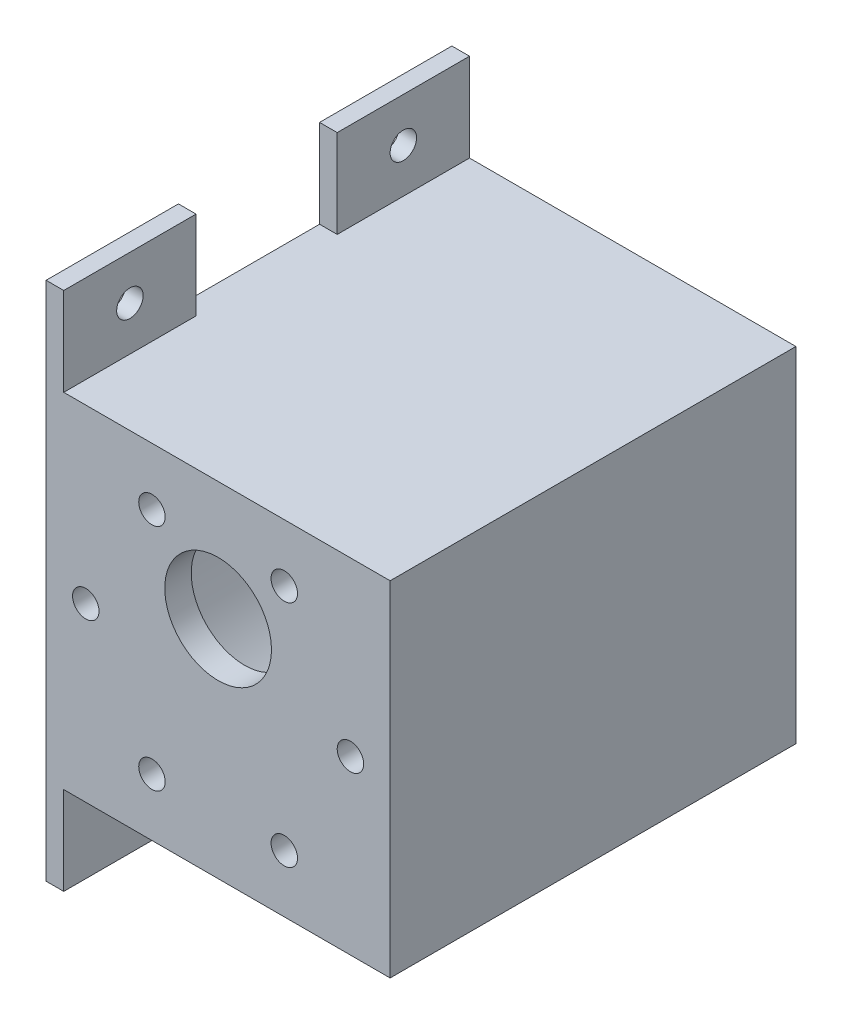
ISO-10303-21;
HEADER;
FILE_DESCRIPTION(('STEP AP214'),'2;1');
FILE_NAME('part.step','',(''),(''),'','','');
FILE_SCHEMA(('AUTOMOTIVE_DESIGN { 1 0 10303 214 1 1 1 1 }'));
ENDSEC;
DATA;
#1=APPLICATION_CONTEXT('core data for automotive mechanical design processes');
#2=APPLICATION_PROTOCOL_DEFINITION('international standard','automotive_design',2000,#1);
#3=PRODUCT_CONTEXT('',#1,'mechanical');
#4=PRODUCT('Part','Part','',(#3));
#5=PRODUCT_RELATED_PRODUCT_CATEGORY('part','',(#4));
#6=PRODUCT_DEFINITION_FORMATION('','',#4);
#7=PRODUCT_DEFINITION_CONTEXT('part definition',#1,'design');
#8=PRODUCT_DEFINITION('design','',#6,#7);
#9=PRODUCT_DEFINITION_SHAPE('','',#8);
#10=(LENGTH_UNIT() NAMED_UNIT(*) SI_UNIT(.MILLI.,.METRE.));
#11=(NAMED_UNIT(*) PLANE_ANGLE_UNIT() SI_UNIT($,.RADIAN.));
#12=(NAMED_UNIT(*) SI_UNIT($,.STERADIAN.) SOLID_ANGLE_UNIT());
#13=UNCERTAINTY_MEASURE_WITH_UNIT(LENGTH_MEASURE(1.E-05),#10,'distance_accuracy_value','');
#14=(GEOMETRIC_REPRESENTATION_CONTEXT(3) GLOBAL_UNCERTAINTY_ASSIGNED_CONTEXT((#13)) GLOBAL_UNIT_ASSIGNED_CONTEXT((#10,
#11,#12)) REPRESENTATION_CONTEXT('',''));
#15=CARTESIAN_POINT('',(0.,0.,0.));
#16=DIRECTION('',(0.,0.,1.));
#17=DIRECTION('',(1.,0.,0.));
#18=AXIS2_PLACEMENT_3D('',#15,#16,#17);
#19=CARTESIAN_POINT('',(-19.5,19.5,-18.));
#20=DIRECTION('',(0.,1.,0.));
#21=DIRECTION('',(0.,0.,1.));
#22=AXIS2_PLACEMENT_3D('',#19,#20,#21);
#23=PLANE('',#22);
#24=DIRECTION('',(-1.,0.,0.));
#25=VECTOR('',#24,1.);
#26=CARTESIAN_POINT('',(-17.5,19.5,-12.));
#27=LINE('',#26,#25);
#28=CARTESIAN_POINT('',(-17.5,19.5,-12.));
#29=VERTEX_POINT('',#28);
#30=CARTESIAN_POINT('',(-19.5,19.5,-12.));
#31=VERTEX_POINT('',#30);
#32=EDGE_CURVE('E51',#29,#31,#27,.T.);
#33=ORIENTED_EDGE('',*,*,#32,.F.);
#34=DIRECTION('',(0.,0.,1.));
#35=VECTOR('',#34,1.);
#36=CARTESIAN_POINT('',(-17.5,19.5,-12.));
#37=LINE('',#36,#35);
#38=CARTESIAN_POINT('',(-17.5,19.5,3.));
#39=VERTEX_POINT('',#38);
#40=EDGE_CURVE('E55',#29,#39,#37,.T.);
#41=ORIENTED_EDGE('',*,*,#40,.T.);
#42=DIRECTION('',(-1.,0.,0.));
#43=VECTOR('',#42,1.);
#44=CARTESIAN_POINT('',(-19.5,19.5,3.));
#45=LINE('',#44,#43);
#46=CARTESIAN_POINT('',(19.5,19.5,3.));
#47=VERTEX_POINT('',#46);
#48=EDGE_CURVE('E454',#47,#39,#45,.T.);
#49=ORIENTED_EDGE('',*,*,#48,.F.);
#50=DIRECTION('',(0.,0.,1.));
#51=VECTOR('',#50,1.);
#52=CARTESIAN_POINT('',(19.5,19.5,-18.));
#53=LINE('',#52,#51);
#54=CARTESIAN_POINT('',(19.5,19.5,-43.));
#55=VERTEX_POINT('',#54);
#56=EDGE_CURVE('E336',#55,#47,#53,.T.);
#57=ORIENTED_EDGE('',*,*,#56,.F.);
#58=DIRECTION('',(1.,0.,0.));
#59=VECTOR('',#58,1.);
#60=CARTESIAN_POINT('',(19.5,19.5,-43.));
#61=LINE('',#60,#59);
#62=CARTESIAN_POINT('',(-17.5,19.5,-43.));
#63=VERTEX_POINT('',#62);
#64=EDGE_CURVE('E340',#63,#55,#61,.T.);
#65=ORIENTED_EDGE('',*,*,#64,.F.);
#66=DIRECTION('',(0.,0.,1.));
#67=VECTOR('',#66,1.);
#68=CARTESIAN_POINT('',(-17.5,19.5,-43.));
#69=LINE('',#68,#67);
#70=CARTESIAN_POINT('',(-17.5,19.5,-28.));
#71=VERTEX_POINT('',#70);
#72=EDGE_CURVE('E295',#63,#71,#69,.T.);
#73=ORIENTED_EDGE('',*,*,#72,.T.);
#74=DIRECTION('',(-1.,0.,0.));
#75=VECTOR('',#74,1.);
#76=CARTESIAN_POINT('',(-17.5,19.5,-28.));
#77=LINE('',#76,#75);
#78=CARTESIAN_POINT('',(-19.5,19.5,-28.));
#79=VERTEX_POINT('',#78);
#80=EDGE_CURVE('E308',#71,#79,#77,.T.);
#81=ORIENTED_EDGE('',*,*,#80,.T.);
#82=DIRECTION('',(0.,0.,1.));
#83=VECTOR('',#82,1.);
#84=CARTESIAN_POINT('',(-19.5,19.5,-18.));
#85=LINE('',#84,#83);
#86=EDGE_CURVE('E329',#79,#31,#85,.T.);
#87=ORIENTED_EDGE('',*,*,#86,.T.);
#88=EDGE_LOOP('',(#33,#41,#49,#57,#65,#73,#81,#87));
#89=FACE_BOUND('',#88,.T.);
#90=ADVANCED_FACE('F34',(#89),#23,.T.);
#91=CARTESIAN_POINT('',(0.,0.,3.));
#92=DIRECTION('',(0.,0.,1.));
#93=DIRECTION('',(1.,0.,0.));
#94=AXIS2_PLACEMENT_3D('',#91,#92,#93);
#95=PLANE('',#94);
#96=CARTESIAN_POINT('',(0.,6.,3.));
#97=DIRECTION('',(0.,0.,1.));
#98=DIRECTION('',(1.,0.,0.));
#99=AXIS2_PLACEMENT_3D('',#96,#97,#98);
#100=CIRCLE('',#99,6.05);
#101=CARTESIAN_POINT('',(6.05,6.,3.));
#102=VERTEX_POINT('',#101);
#103=EDGE_CURVE('E462',#102,#102,#100,.T.);
#104=ORIENTED_EDGE('',*,*,#103,.F.);
#105=EDGE_LOOP('',(#104));
#106=FACE_BOUND('',#105,.T.);
#107=CARTESIAN_POINT('',(-7.50000000000015,12.9903810567665,3.));
#108=DIRECTION('',(0.,0.,1.));
#109=DIRECTION('',(0.50000000000001,-0.866025403784433,0.));
#110=AXIS2_PLACEMENT_3D('',#107,#108,#109);
#111=CIRCLE('',#110,1.5);
#112=CARTESIAN_POINT('',(-6.75000000000014,11.6913429510898,3.));
#113=VERTEX_POINT('',#112);
#114=EDGE_CURVE('E850',#113,#113,#111,.T.);
#115=ORIENTED_EDGE('',*,*,#114,.F.);
#116=EDGE_LOOP('',(#115));
#117=FACE_BOUND('',#116,.T.);
#118=CARTESIAN_POINT('',(7.49999999999988,12.9903810567666,3.));
#119=DIRECTION('',(0.,0.,1.));
#120=DIRECTION('',(-0.499999999999992,-0.866025403784443,0.));
#121=AXIS2_PLACEMENT_3D('',#118,#119,#120);
#122=CIRCLE('',#121,1.5);
#123=CARTESIAN_POINT('',(6.74999999999989,11.69134295109,3.));
#124=VERTEX_POINT('',#123);
#125=EDGE_CURVE('E855',#124,#124,#122,.T.);
#126=ORIENTED_EDGE('',*,*,#125,.F.);
#127=EDGE_LOOP('',(#126));
#128=FACE_BOUND('',#127,.T.);
#129=CARTESIAN_POINT('',(15.,0.,3.));
#130=DIRECTION('',(0.,0.,1.));
#131=DIRECTION('',(-1.,0.,0.));
#132=AXIS2_PLACEMENT_3D('',#129,#130,#131);
#133=CIRCLE('',#132,1.5);
#134=CARTESIAN_POINT('',(13.5,0.,3.));
#135=VERTEX_POINT('',#134);
#136=EDGE_CURVE('E861',#135,#135,#133,.T.);
#137=ORIENTED_EDGE('',*,*,#136,.F.);
#138=EDGE_LOOP('',(#137));
#139=FACE_BOUND('',#138,.T.);
#140=CARTESIAN_POINT('',(7.50000000000006,-12.9903810567665,3.));
#141=DIRECTION('',(0.,0.,1.));
#142=DIRECTION('',(-0.500000000000004,0.866025403784436,0.));
#143=AXIS2_PLACEMENT_3D('',#140,#141,#142);
#144=CIRCLE('',#143,1.5);
#145=CARTESIAN_POINT('',(6.75000000000005,-11.6913429510899,3.));
#146=VERTEX_POINT('',#145);
#147=EDGE_CURVE('E867',#146,#146,#144,.T.);
#148=ORIENTED_EDGE('',*,*,#147,.F.);
#149=EDGE_LOOP('',(#148));
#150=FACE_BOUND('',#149,.T.);
#151=CARTESIAN_POINT('',(-7.49999999999997,-12.9903810567666,3.));
#152=DIRECTION('',(0.,0.,1.));
#153=DIRECTION('',(0.499999999999998,0.86602540378444,0.));
#154=AXIS2_PLACEMENT_3D('',#151,#152,#153);
#155=CIRCLE('',#154,1.5);
#156=CARTESIAN_POINT('',(-6.74999999999997,-11.6913429510899,3.));
#157=VERTEX_POINT('',#156);
#158=EDGE_CURVE('E432',#157,#157,#155,.T.);
#159=ORIENTED_EDGE('',*,*,#158,.F.);
#160=EDGE_LOOP('',(#159));
#161=FACE_BOUND('',#160,.T.);
#162=CARTESIAN_POINT('',(-15.,0.,3.));
#163=DIRECTION('',(0.,0.,1.));
#164=DIRECTION('',(1.,0.,0.));
#165=AXIS2_PLACEMENT_3D('',#162,#163,#164);
#166=CIRCLE('',#165,1.5);
#167=CARTESIAN_POINT('',(-13.5,0.,3.));
#168=VERTEX_POINT('',#167);
#169=EDGE_CURVE('E426',#168,#168,#166,.T.);
#170=ORIENTED_EDGE('',*,*,#169,.F.);
#171=EDGE_LOOP('',(#170));
#172=FACE_BOUND('',#171,.T.);
#173=DIRECTION('',(0.,1.,0.));
#174=VECTOR('',#173,1.);
#175=CARTESIAN_POINT('',(19.5,-19.5,3.));
#176=LINE('',#175,#174);
#177=CARTESIAN_POINT('',(19.5,-19.5,3.));
#178=VERTEX_POINT('',#177);
#179=EDGE_CURVE('E438',#178,#47,#176,.T.);
#180=ORIENTED_EDGE('',*,*,#179,.T.);
#181=ORIENTED_EDGE('',*,*,#48,.T.);
#182=DIRECTION('',(0.,1.,0.));
#183=VECTOR('',#182,1.);
#184=CARTESIAN_POINT('',(-17.5,19.5,3.));
#185=LINE('',#184,#183);
#186=CARTESIAN_POINT('',(-17.5,29.5,3.));
#187=VERTEX_POINT('',#186);
#188=EDGE_CURVE('E222',#39,#187,#185,.T.);
#189=ORIENTED_EDGE('',*,*,#188,.T.);
#190=DIRECTION('',(-1.,0.,0.));
#191=VECTOR('',#190,1.);
#192=CARTESIAN_POINT('',(-17.5,29.5,3.));
#193=LINE('',#192,#191);
#194=CARTESIAN_POINT('',(-19.5,29.5,3.));
#195=VERTEX_POINT('',#194);
#196=EDGE_CURVE('E232',#187,#195,#193,.T.);
#197=ORIENTED_EDGE('',*,*,#196,.T.);
#198=DIRECTION('',(0.,-1.,0.));
#199=VECTOR('',#198,1.);
#200=CARTESIAN_POINT('',(-19.5,-19.5,3.));
#201=LINE('',#200,#199);
#202=CARTESIAN_POINT('',(-19.5,-29.5,2.99999999999997));
#203=VERTEX_POINT('',#202);
#204=EDGE_CURVE('E179',#195,#203,#201,.T.);
#205=ORIENTED_EDGE('',*,*,#204,.T.);
#206=DIRECTION('',(-1.,0.,0.));
#207=VECTOR('',#206,1.);
#208=CARTESIAN_POINT('',(-17.5,-29.5,2.99999999999997));
#209=LINE('',#208,#207);
#210=CARTESIAN_POINT('',(-17.5,-29.5,2.99999999999997));
#211=VERTEX_POINT('',#210);
#212=EDGE_CURVE('E172',#211,#203,#209,.T.);
#213=ORIENTED_EDGE('',*,*,#212,.F.);
#214=DIRECTION('',(0.,1.,0.));
#215=VECTOR('',#214,1.);
#216=CARTESIAN_POINT('',(-17.5,-19.5,2.99999999999997));
#217=LINE('',#216,#215);
#218=CARTESIAN_POINT('',(-17.5,-19.5,2.99999999999997));
#219=VERTEX_POINT('',#218);
#220=EDGE_CURVE('E176',#211,#219,#217,.T.);
#221=ORIENTED_EDGE('',*,*,#220,.T.);
#222=DIRECTION('',(1.,0.,0.));
#223=VECTOR('',#222,1.);
#224=CARTESIAN_POINT('',(-19.5,-19.5,3.));
#225=LINE('',#224,#223);
#226=EDGE_CURVE('E446',#219,#178,#225,.T.);
#227=ORIENTED_EDGE('',*,*,#226,.T.);
#228=EDGE_LOOP('',(#180,#181,#189,#197,#205,#213,#221,#227));
#229=FACE_BOUND('',#228,.T.);
#230=ADVANCED_FACE('F175',(#106,#117,#128,#139,#150,#161,#172,#229),#95,.T.);
#231=CARTESIAN_POINT('',(0.,0.,0.));
#232=DIRECTION('',(0.,0.,1.));
#233=DIRECTION('',(1.,0.,0.));
#234=AXIS2_PLACEMENT_3D('',#231,#232,#233);
#235=PLANE('',#234);
#236=CARTESIAN_POINT('',(0.,6.,0.));
#237=DIRECTION('',(0.,0.,1.));
#238=DIRECTION('',(1.,0.,0.));
#239=AXIS2_PLACEMENT_3D('',#236,#237,#238);
#240=CIRCLE('',#239,6.05);
#241=CARTESIAN_POINT('',(6.05,6.,0.));
#242=VERTEX_POINT('',#241);
#243=EDGE_CURVE('E845',#242,#242,#240,.T.);
#244=ORIENTED_EDGE('',*,*,#243,.T.);
#245=EDGE_LOOP('',(#244));
#246=FACE_BOUND('',#245,.T.);
#247=CARTESIAN_POINT('',(-7.50000000000015,12.9903810567665,0.));
#248=DIRECTION('',(0.,0.,1.));
#249=DIRECTION('',(0.50000000000001,-0.866025403784433,0.));
#250=AXIS2_PLACEMENT_3D('',#247,#248,#249);
#251=CIRCLE('',#250,1.5);
#252=CARTESIAN_POINT('',(-6.75000000000014,11.6913429510898,0.));
#253=VERTEX_POINT('',#252);
#254=EDGE_CURVE('E852',#253,#253,#251,.T.);
#255=ORIENTED_EDGE('',*,*,#254,.T.);
#256=EDGE_LOOP('',(#255));
#257=FACE_BOUND('',#256,.T.);
#258=CARTESIAN_POINT('',(7.49999999999988,12.9903810567666,0.));
#259=DIRECTION('',(0.,0.,1.));
#260=DIRECTION('',(-0.499999999999992,-0.866025403784443,0.));
#261=AXIS2_PLACEMENT_3D('',#258,#259,#260);
#262=CIRCLE('',#261,1.5);
#263=CARTESIAN_POINT('',(6.74999999999989,11.69134295109,0.));
#264=VERTEX_POINT('',#263);
#265=EDGE_CURVE('E858',#264,#264,#262,.T.);
#266=ORIENTED_EDGE('',*,*,#265,.T.);
#267=EDGE_LOOP('',(#266));
#268=FACE_BOUND('',#267,.T.);
#269=CARTESIAN_POINT('',(15.,0.,0.));
#270=DIRECTION('',(0.,0.,1.));
#271=DIRECTION('',(-1.,0.,0.));
#272=AXIS2_PLACEMENT_3D('',#269,#270,#271);
#273=CIRCLE('',#272,1.5);
#274=CARTESIAN_POINT('',(13.5,0.,0.));
#275=VERTEX_POINT('',#274);
#276=EDGE_CURVE('E864',#275,#275,#273,.T.);
#277=ORIENTED_EDGE('',*,*,#276,.T.);
#278=EDGE_LOOP('',(#277));
#279=FACE_BOUND('',#278,.T.);
#280=CARTESIAN_POINT('',(7.50000000000006,-12.9903810567665,0.));
#281=DIRECTION('',(0.,0.,1.));
#282=DIRECTION('',(-0.500000000000004,0.866025403784436,0.));
#283=AXIS2_PLACEMENT_3D('',#280,#281,#282);
#284=CIRCLE('',#283,1.5);
#285=CARTESIAN_POINT('',(6.75000000000005,-11.6913429510899,0.));
#286=VERTEX_POINT('',#285);
#287=EDGE_CURVE('E870',#286,#286,#284,.T.);
#288=ORIENTED_EDGE('',*,*,#287,.T.);
#289=EDGE_LOOP('',(#288));
#290=FACE_BOUND('',#289,.T.);
#291=CARTESIAN_POINT('',(-7.49999999999997,-12.9903810567666,0.));
#292=DIRECTION('',(0.,0.,1.));
#293=DIRECTION('',(0.499999999999998,0.86602540378444,0.));
#294=AXIS2_PLACEMENT_3D('',#291,#292,#293);
#295=CIRCLE('',#294,1.5);
#296=CARTESIAN_POINT('',(-6.74999999999997,-11.6913429510899,0.));
#297=VERTEX_POINT('',#296);
#298=EDGE_CURVE('E428',#297,#297,#295,.T.);
#299=ORIENTED_EDGE('',*,*,#298,.T.);
#300=EDGE_LOOP('',(#299));
#301=FACE_BOUND('',#300,.T.);
#302=CARTESIAN_POINT('',(-15.,0.,0.));
#303=DIRECTION('',(0.,0.,1.));
#304=DIRECTION('',(1.,0.,0.));
#305=AXIS2_PLACEMENT_3D('',#302,#303,#304);
#306=CIRCLE('',#305,1.5);
#307=CARTESIAN_POINT('',(-13.5,0.,0.));
#308=VERTEX_POINT('',#307);
#309=EDGE_CURVE('E43',#308,#308,#306,.T.);
#310=ORIENTED_EDGE('',*,*,#309,.T.);
#311=EDGE_LOOP('',(#310));
#312=FACE_BOUND('',#311,.T.);
#313=CARTESIAN_POINT('',(0.,0.,0.));
#314=DIRECTION('',(0.,0.,1.));
#315=DIRECTION('',(1.,0.,0.));
#316=AXIS2_PLACEMENT_3D('',#313,#314,#315);
#317=CIRCLE('',#316,18.05);
#318=CARTESIAN_POINT('',(18.05,0.,0.));
#319=VERTEX_POINT('',#318);
#320=EDGE_CURVE('E11',#319,#319,#317,.T.);
#321=ORIENTED_EDGE('',*,*,#320,.F.);
#322=EDGE_LOOP('',(#321));
#323=FACE_BOUND('',#322,.T.);
#324=ADVANCED_FACE('F36',(#246,#257,#268,#279,#290,#301,#312,#323),#235,.F.);
#325=CARTESIAN_POINT('',(-15.,0.,0.));
#326=DIRECTION('',(0.,0.,1.));
#327=DIRECTION('',(1.,0.,0.));
#328=AXIS2_PLACEMENT_3D('',#325,#326,#327);
#329=CYLINDRICAL_SURFACE('',#328,1.5);
#330=ORIENTED_EDGE('',*,*,#309,.F.);
#331=EDGE_LOOP('',(#330));
#332=FACE_BOUND('',#331,.T.);
#333=ORIENTED_EDGE('',*,*,#169,.T.);
#334=EDGE_LOOP('',(#333));
#335=FACE_BOUND('',#334,.T.);
#336=ADVANCED_FACE('F413',(#332,#335),#329,.F.);
#337=CARTESIAN_POINT('',(-7.49999999999997,-12.9903810567666,0.));
#338=DIRECTION('',(0.,0.,1.));
#339=DIRECTION('',(1.,0.,0.));
#340=AXIS2_PLACEMENT_3D('',#337,#338,#339);
#341=CYLINDRICAL_SURFACE('',#340,1.5);
#342=ORIENTED_EDGE('',*,*,#298,.F.);
#343=EDGE_LOOP('',(#342));
#344=FACE_BOUND('',#343,.T.);
#345=ORIENTED_EDGE('',*,*,#158,.T.);
#346=EDGE_LOOP('',(#345));
#347=FACE_BOUND('',#346,.T.);
#348=ADVANCED_FACE('F409',(#344,#347),#341,.F.);
#349=CARTESIAN_POINT('',(7.50000000000006,-12.9903810567665,0.));
#350=DIRECTION('',(0.,0.,1.));
#351=DIRECTION('',(1.,0.,0.));
#352=AXIS2_PLACEMENT_3D('',#349,#350,#351);
#353=CYLINDRICAL_SURFACE('',#352,1.5);
#354=ORIENTED_EDGE('',*,*,#287,.F.);
#355=EDGE_LOOP('',(#354));
#356=FACE_BOUND('',#355,.T.);
#357=ORIENTED_EDGE('',*,*,#147,.T.);
#358=EDGE_LOOP('',(#357));
#359=FACE_BOUND('',#358,.T.);
#360=ADVANCED_FACE('F405',(#356,#359),#353,.F.);
#361=CARTESIAN_POINT('',(15.,0.,0.));
#362=DIRECTION('',(0.,0.,1.));
#363=DIRECTION('',(1.,0.,0.));
#364=AXIS2_PLACEMENT_3D('',#361,#362,#363);
#365=CYLINDRICAL_SURFACE('',#364,1.5);
#366=ORIENTED_EDGE('',*,*,#276,.F.);
#367=EDGE_LOOP('',(#366));
#368=FACE_BOUND('',#367,.T.);
#369=ORIENTED_EDGE('',*,*,#136,.T.);
#370=EDGE_LOOP('',(#369));
#371=FACE_BOUND('',#370,.T.);
#372=ADVANCED_FACE('F401',(#368,#371),#365,.F.);
#373=CARTESIAN_POINT('',(7.49999999999988,12.9903810567666,0.));
#374=DIRECTION('',(0.,0.,1.));
#375=DIRECTION('',(1.,0.,0.));
#376=AXIS2_PLACEMENT_3D('',#373,#374,#375);
#377=CYLINDRICAL_SURFACE('',#376,1.5);
#378=ORIENTED_EDGE('',*,*,#265,.F.);
#379=EDGE_LOOP('',(#378));
#380=FACE_BOUND('',#379,.T.);
#381=ORIENTED_EDGE('',*,*,#125,.T.);
#382=EDGE_LOOP('',(#381));
#383=FACE_BOUND('',#382,.T.);
#384=ADVANCED_FACE('F397',(#380,#383),#377,.F.);
#385=CARTESIAN_POINT('',(-7.50000000000015,12.9903810567665,0.));
#386=DIRECTION('',(0.,0.,1.));
#387=DIRECTION('',(1.,0.,0.));
#388=AXIS2_PLACEMENT_3D('',#385,#386,#387);
#389=CYLINDRICAL_SURFACE('',#388,1.5);
#390=ORIENTED_EDGE('',*,*,#254,.F.);
#391=EDGE_LOOP('',(#390));
#392=FACE_BOUND('',#391,.T.);
#393=ORIENTED_EDGE('',*,*,#114,.T.);
#394=EDGE_LOOP('',(#393));
#395=FACE_BOUND('',#394,.T.);
#396=ADVANCED_FACE('F393',(#392,#395),#389,.F.);
#397=CARTESIAN_POINT('',(0.,6.,0.));
#398=DIRECTION('',(0.,0.,1.));
#399=DIRECTION('',(1.,0.,0.));
#400=AXIS2_PLACEMENT_3D('',#397,#398,#399);
#401=CYLINDRICAL_SURFACE('',#400,6.05);
#402=ORIENTED_EDGE('',*,*,#243,.F.);
#403=EDGE_LOOP('',(#402));
#404=FACE_BOUND('',#403,.T.);
#405=ORIENTED_EDGE('',*,*,#103,.T.);
#406=EDGE_LOOP('',(#405));
#407=FACE_BOUND('',#406,.T.);
#408=ADVANCED_FACE('F390',(#404,#407),#401,.F.);
#409=CARTESIAN_POINT('',(0.,0.,-18.));
#410=DIRECTION('',(0.,0.,1.));
#411=DIRECTION('',(1.,0.,0.));
#412=AXIS2_PLACEMENT_3D('',#409,#410,#411);
#413=CYLINDRICAL_SURFACE('',#412,18.05);
#414=CARTESIAN_POINT('',(0.,0.,-18.));
#415=DIRECTION('',(0.,0.,1.));
#416=DIRECTION('',(1.,0.,0.));
#417=AXIS2_PLACEMENT_3D('',#414,#415,#416);
#418=CIRCLE('',#417,18.05);
#419=CARTESIAN_POINT('',(0.,18.05,-18.));
#420=VERTEX_POINT('',#419);
#421=CARTESIAN_POINT('',(0.,-18.05,-18.));
#422=VERTEX_POINT('',#421);
#423=EDGE_CURVE('E436',#420,#422,#418,.T.);
#424=ORIENTED_EDGE('',*,*,#423,.F.);
#425=DIRECTION('',(0.,0.,1.));
#426=VECTOR('',#425,1.);
#427=CARTESIAN_POINT('',(0.,18.05,-43.));
#428=LINE('',#427,#426);
#429=CARTESIAN_POINT('',(0.,18.05,-43.));
#430=VERTEX_POINT('',#429);
#431=EDGE_CURVE('E439',#430,#420,#428,.T.);
#432=ORIENTED_EDGE('',*,*,#431,.F.);
#433=CARTESIAN_POINT('',(0.,0.,-43.));
#434=DIRECTION('',(0.,0.,1.));
#435=DIRECTION('',(-1.,0.,0.));
#436=AXIS2_PLACEMENT_3D('',#433,#434,#435);
#437=CIRCLE('',#436,18.05);
#438=CARTESIAN_POINT('',(0.,-18.05,-43.));
#439=VERTEX_POINT('',#438);
#440=EDGE_CURVE('E311',#439,#430,#437,.T.);
#441=ORIENTED_EDGE('',*,*,#440,.F.);
#442=DIRECTION('',(0.,0.,1.));
#443=VECTOR('',#442,1.);
#444=CARTESIAN_POINT('',(0.,-18.05,-43.));
#445=LINE('',#444,#443);
#446=EDGE_CURVE('E776',#439,#422,#445,.T.);
#447=ORIENTED_EDGE('',*,*,#446,.T.);
#448=EDGE_LOOP('',(#424,#432,#441,#447));
#449=FACE_BOUND('',#448,.T.);
#450=ORIENTED_EDGE('',*,*,#320,.T.);
#451=EDGE_LOOP('',(#450));
#452=FACE_BOUND('',#451,.T.);
#453=ADVANCED_FACE('F388',(#449,#452),#413,.F.);
#454=CARTESIAN_POINT('',(19.5,-19.5,-18.));
#455=DIRECTION('',(1.,0.,0.));
#456=DIRECTION('',(0.,0.,-1.));
#457=AXIS2_PLACEMENT_3D('',#454,#455,#456);
#458=PLANE('',#457);
#459=ORIENTED_EDGE('',*,*,#179,.F.);
#460=DIRECTION('',(0.,0.,1.));
#461=VECTOR('',#460,1.);
#462=CARTESIAN_POINT('',(19.5,-19.5,-18.));
#463=LINE('',#462,#461);
#464=CARTESIAN_POINT('',(19.5,-19.5,-43.));
#465=VERTEX_POINT('',#464);
#466=EDGE_CURVE('E328',#465,#178,#463,.T.);
#467=ORIENTED_EDGE('',*,*,#466,.F.);
#468=DIRECTION('',(0.,-1.,0.));
#469=VECTOR('',#468,1.);
#470=CARTESIAN_POINT('',(19.5,-19.5,-43.));
#471=LINE('',#470,#469);
#472=EDGE_CURVE('E463',#55,#465,#471,.T.);
#473=ORIENTED_EDGE('',*,*,#472,.F.);
#474=ORIENTED_EDGE('',*,*,#56,.T.);
#475=EDGE_LOOP('',(#459,#467,#473,#474));
#476=FACE_BOUND('',#475,.T.);
#477=ADVANCED_FACE('F384',(#476),#458,.T.);
#478=CARTESIAN_POINT('',(-19.5,-19.5,-18.));
#479=DIRECTION('',(0.,-1.,0.));
#480=DIRECTION('',(0.,0.,-1.));
#481=AXIS2_PLACEMENT_3D('',#478,#479,#480);
#482=PLANE('',#481);
#483=DIRECTION('',(-1.,0.,0.));
#484=VECTOR('',#483,1.);
#485=CARTESIAN_POINT('',(-17.5,-19.5,-12.));
#486=LINE('',#485,#484);
#487=CARTESIAN_POINT('',(-17.5,-19.5,-12.));
#488=VERTEX_POINT('',#487);
#489=CARTESIAN_POINT('',(-19.5,-19.5,-12.));
#490=VERTEX_POINT('',#489);
#491=EDGE_CURVE('E184',#488,#490,#486,.T.);
#492=ORIENTED_EDGE('',*,*,#491,.T.);
#493=DIRECTION('',(0.,0.,1.));
#494=VECTOR('',#493,1.);
#495=CARTESIAN_POINT('',(-19.5,-19.5,-18.));
#496=LINE('',#495,#494);
#497=CARTESIAN_POINT('',(-19.5,-19.5,-28.));
#498=VERTEX_POINT('',#497);
#499=EDGE_CURVE('E326',#498,#490,#496,.T.);
#500=ORIENTED_EDGE('',*,*,#499,.F.);
#501=DIRECTION('',(-1.,0.,0.));
#502=VECTOR('',#501,1.);
#503=CARTESIAN_POINT('',(-17.5,-19.5,-28.));
#504=LINE('',#503,#502);
#505=CARTESIAN_POINT('',(-17.5,-19.5,-28.));
#506=VERTEX_POINT('',#505);
#507=EDGE_CURVE('E266',#506,#498,#504,.T.);
#508=ORIENTED_EDGE('',*,*,#507,.F.);
#509=DIRECTION('',(0.,0.,-1.));
#510=VECTOR('',#509,1.);
#511=CARTESIAN_POINT('',(-17.5,-19.5,-43.));
#512=LINE('',#511,#510);
#513=CARTESIAN_POINT('',(-17.5,-19.5,-43.));
#514=VERTEX_POINT('',#513);
#515=EDGE_CURVE('E253',#506,#514,#512,.T.);
#516=ORIENTED_EDGE('',*,*,#515,.T.);
#517=DIRECTION('',(-1.,0.,0.));
#518=VECTOR('',#517,1.);
#519=CARTESIAN_POINT('',(-19.5,-19.5,-43.));
#520=LINE('',#519,#518);
#521=EDGE_CURVE('E259',#465,#514,#520,.T.);
#522=ORIENTED_EDGE('',*,*,#521,.F.);
#523=ORIENTED_EDGE('',*,*,#466,.T.);
#524=ORIENTED_EDGE('',*,*,#226,.F.);
#525=DIRECTION('',(0.,0.,-1.));
#526=VECTOR('',#525,1.);
#527=CARTESIAN_POINT('',(-17.5,-19.5,-12.));
#528=LINE('',#527,#526);
#529=EDGE_CURVE('E194',#219,#488,#528,.T.);
#530=ORIENTED_EDGE('',*,*,#529,.T.);
#531=EDGE_LOOP('',(#492,#500,#508,#516,#522,#523,#524,#530));
#532=FACE_BOUND('',#531,.T.);
#533=ADVANCED_FACE('F387',(#532),#482,.T.);
#534=CARTESIAN_POINT('',(-19.5,-19.5,-18.));
#535=DIRECTION('',(-1.,0.,0.));
#536=DIRECTION('',(0.,0.,1.));
#537=AXIS2_PLACEMENT_3D('',#534,#535,#536);
#538=PLANE('',#537);
#539=ORIENTED_EDGE('',*,*,#204,.F.);
#540=DIRECTION('',(0.,0.,-1.));
#541=VECTOR('',#540,1.);
#542=CARTESIAN_POINT('',(-19.5,29.5,3.));
#543=LINE('',#542,#541);
#544=CARTESIAN_POINT('',(-19.5,29.5,-12.));
#545=VERTEX_POINT('',#544);
#546=EDGE_CURVE('E218',#195,#545,#543,.T.);
#547=ORIENTED_EDGE('',*,*,#546,.T.);
#548=DIRECTION('',(0.,-1.,0.));
#549=VECTOR('',#548,1.);
#550=CARTESIAN_POINT('',(-19.5,29.5,-12.));
#551=LINE('',#550,#549);
#552=EDGE_CURVE('E223',#545,#31,#551,.T.);
#553=ORIENTED_EDGE('',*,*,#552,.T.);
#554=ORIENTED_EDGE('',*,*,#86,.F.);
#555=DIRECTION('',(0.,1.,0.));
#556=VECTOR('',#555,1.);
#557=CARTESIAN_POINT('',(-19.5,19.5,-28.));
#558=LINE('',#557,#556);
#559=CARTESIAN_POINT('',(-19.5,29.5,-28.));
#560=VERTEX_POINT('',#559);
#561=EDGE_CURVE('E288',#79,#560,#558,.T.);
#562=ORIENTED_EDGE('',*,*,#561,.T.);
#563=DIRECTION('',(0.,0.,-1.));
#564=VECTOR('',#563,1.);
#565=CARTESIAN_POINT('',(-19.5,29.5,-28.));
#566=LINE('',#565,#564);
#567=CARTESIAN_POINT('',(-19.5,29.5,-43.));
#568=VERTEX_POINT('',#567);
#569=EDGE_CURVE('E299',#560,#568,#566,.T.);
#570=ORIENTED_EDGE('',*,*,#569,.T.);
#571=DIRECTION('',(0.,1.,0.));
#572=VECTOR('',#571,1.);
#573=CARTESIAN_POINT('',(-19.5,18.05,-43.));
#574=LINE('',#573,#572);
#575=CARTESIAN_POINT('',(-19.5,18.05,-43.));
#576=VERTEX_POINT('',#575);
#577=EDGE_CURVE('E362',#576,#568,#574,.T.);
#578=ORIENTED_EDGE('',*,*,#577,.F.);
#579=DIRECTION('',(0.,0.,1.));
#580=VECTOR('',#579,1.);
#581=CARTESIAN_POINT('',(-19.5,18.05,-43.));
#582=LINE('',#581,#580);
#583=CARTESIAN_POINT('',(-19.5,18.05,-18.));
#584=VERTEX_POINT('',#583);
#585=EDGE_CURVE('E782',#576,#584,#582,.T.);
#586=ORIENTED_EDGE('',*,*,#585,.T.);
#587=DIRECTION('',(0.,-1.,0.));
#588=VECTOR('',#587,1.);
#589=CARTESIAN_POINT('',(-19.5,-19.5,-18.));
#590=LINE('',#589,#588);
#591=CARTESIAN_POINT('',(-19.5,-18.05,-18.));
#592=VERTEX_POINT('',#591);
#593=EDGE_CURVE('E442',#584,#592,#590,.T.);
#594=ORIENTED_EDGE('',*,*,#593,.T.);
#595=DIRECTION('',(0.,0.,1.));
#596=VECTOR('',#595,1.);
#597=CARTESIAN_POINT('',(-19.5,-18.05,-43.));
#598=LINE('',#597,#596);
#599=CARTESIAN_POINT('',(-19.5,-18.05,-43.));
#600=VERTEX_POINT('',#599);
#601=EDGE_CURVE('E784',#600,#592,#598,.T.);
#602=ORIENTED_EDGE('',*,*,#601,.F.);
#603=DIRECTION('',(0.,1.,0.));
#604=VECTOR('',#603,1.);
#605=CARTESIAN_POINT('',(-19.5,-18.05,-43.));
#606=LINE('',#605,#604);
#607=CARTESIAN_POINT('',(-19.5,-29.5,-43.));
#608=VERTEX_POINT('',#607);
#609=EDGE_CURVE('E800',#608,#600,#606,.T.);
#610=ORIENTED_EDGE('',*,*,#609,.F.);
#611=DIRECTION('',(0.,0.,1.));
#612=VECTOR('',#611,1.);
#613=CARTESIAN_POINT('',(-19.5,-29.5,-28.));
#614=LINE('',#613,#612);
#615=CARTESIAN_POINT('',(-19.5,-29.5,-28.));
#616=VERTEX_POINT('',#615);
#617=EDGE_CURVE('E245',#608,#616,#614,.T.);
#618=ORIENTED_EDGE('',*,*,#617,.T.);
#619=DIRECTION('',(0.,1.,0.));
#620=VECTOR('',#619,1.);
#621=CARTESIAN_POINT('',(-19.5,-19.5,-28.));
#622=LINE('',#621,#620);
#623=EDGE_CURVE('E258',#616,#498,#622,.T.);
#624=ORIENTED_EDGE('',*,*,#623,.T.);
#625=ORIENTED_EDGE('',*,*,#499,.T.);
#626=DIRECTION('',(0.,-1.,0.));
#627=VECTOR('',#626,1.);
#628=CARTESIAN_POINT('',(-19.5,-29.5,-12.));
#629=LINE('',#628,#627);
#630=CARTESIAN_POINT('',(-19.5,-29.5,-12.));
#631=VERTEX_POINT('',#630);
#632=EDGE_CURVE('E198',#490,#631,#629,.T.);
#633=ORIENTED_EDGE('',*,*,#632,.T.);
#634=DIRECTION('',(0.,0.,1.));
#635=VECTOR('',#634,1.);
#636=CARTESIAN_POINT('',(-19.5,-29.5,2.99999999999997));
#637=LINE('',#636,#635);
#638=EDGE_CURVE('E201',#631,#203,#637,.T.);
#639=ORIENTED_EDGE('',*,*,#638,.T.);
#640=EDGE_LOOP('',(#539,#547,#553,#554,#562,#570,#578,#586,#594,#602,#610,#618,#624,#625,#633,#639));
#641=FACE_BOUND('',#640,.T.);
#642=CARTESIAN_POINT('',(-19.5,24.5,-35.5));
#643=DIRECTION('',(-1.,0.,0.));
#644=DIRECTION('',(0.,0.,1.));
#645=AXIS2_PLACEMENT_3D('',#642,#643,#644);
#646=CIRCLE('',#645,1.5);
#647=CARTESIAN_POINT('',(-19.5,24.5,-34.));
#648=VERTEX_POINT('',#647);
#649=EDGE_CURVE('E268',#648,#648,#646,.T.);
#650=ORIENTED_EDGE('',*,*,#649,.F.);
#651=EDGE_LOOP('',(#650));
#652=FACE_BOUND('',#651,.T.);
#653=CARTESIAN_POINT('',(-19.5,-24.5,-35.5));
#654=DIRECTION('',(-1.,0.,0.));
#655=DIRECTION('',(0.,0.,-1.));
#656=AXIS2_PLACEMENT_3D('',#653,#654,#655);
#657=CIRCLE('',#656,1.5);
#658=CARTESIAN_POINT('',(-19.5,-24.5,-37.));
#659=VERTEX_POINT('',#658);
#660=EDGE_CURVE('E238',#659,#659,#657,.T.);
#661=ORIENTED_EDGE('',*,*,#660,.F.);
#662=EDGE_LOOP('',(#661));
#663=FACE_BOUND('',#662,.T.);
#664=CARTESIAN_POINT('',(-19.5,24.5,-4.5));
#665=DIRECTION('',(-1.,0.,0.));
#666=DIRECTION('',(0.,0.,1.));
#667=AXIS2_PLACEMENT_3D('',#664,#665,#666);
#668=CIRCLE('',#667,1.5);
#669=CARTESIAN_POINT('',(-19.5,24.5,-3.));
#670=VERTEX_POINT('',#669);
#671=EDGE_CURVE('E212',#670,#670,#668,.T.);
#672=ORIENTED_EDGE('',*,*,#671,.F.);
#673=EDGE_LOOP('',(#672));
#674=FACE_BOUND('',#673,.T.);
#675=CARTESIAN_POINT('',(-19.5,-24.5,-4.50000000000003));
#676=DIRECTION('',(-1.,0.,0.));
#677=DIRECTION('',(0.,0.,-1.));
#678=AXIS2_PLACEMENT_3D('',#675,#676,#677);
#679=CIRCLE('',#678,1.5);
#680=CARTESIAN_POINT('',(-19.5,-24.5,-6.00000000000003));
#681=VERTEX_POINT('',#680);
#682=EDGE_CURVE('E204',#681,#681,#679,.T.);
#683=ORIENTED_EDGE('',*,*,#682,.F.);
#684=EDGE_LOOP('',(#683));
#685=FACE_BOUND('',#684,.T.);
#686=ADVANCED_FACE('F345',(#641,#652,#663,#674,#685),#538,.T.);
#687=CARTESIAN_POINT('',(0.,0.,-18.));
#688=DIRECTION('',(0.,0.,-1.));
#689=DIRECTION('',(-1.,0.,0.));
#690=AXIS2_PLACEMENT_3D('',#687,#688,#689);
#691=PLANE('',#690);
#692=DIRECTION('',(1.,0.,0.));
#693=VECTOR('',#692,1.);
#694=CARTESIAN_POINT('',(0.,-18.05,-18.));
#695=LINE('',#694,#693);
#696=EDGE_CURVE('E790',#592,#422,#695,.T.);
#697=ORIENTED_EDGE('',*,*,#696,.F.);
#698=ORIENTED_EDGE('',*,*,#593,.F.);
#699=DIRECTION('',(-1.,0.,0.));
#700=VECTOR('',#699,1.);
#701=CARTESIAN_POINT('',(0.,18.05,-18.));
#702=LINE('',#701,#700);
#703=EDGE_CURVE('E305',#420,#584,#702,.T.);
#704=ORIENTED_EDGE('',*,*,#703,.F.);
#705=ORIENTED_EDGE('',*,*,#423,.T.);
#706=EDGE_LOOP('',(#697,#698,#704,#705));
#707=FACE_BOUND('',#706,.T.);
#708=ADVANCED_FACE('F512',(#707),#691,.T.);
#709=CARTESIAN_POINT('',(0.,18.05,-43.));
#710=DIRECTION('',(0.,1.,0.));
#711=DIRECTION('',(0.,0.,1.));
#712=AXIS2_PLACEMENT_3D('',#709,#710,#711);
#713=PLANE('',#712);
#714=ORIENTED_EDGE('',*,*,#703,.T.);
#715=ORIENTED_EDGE('',*,*,#585,.F.);
#716=DIRECTION('',(-1.,0.,0.));
#717=VECTOR('',#716,1.);
#718=CARTESIAN_POINT('',(0.,18.05,-43.));
#719=LINE('',#718,#717);
#720=EDGE_CURVE('E781',#430,#576,#719,.T.);
#721=ORIENTED_EDGE('',*,*,#720,.F.);
#722=ORIENTED_EDGE('',*,*,#431,.T.);
#723=EDGE_LOOP('',(#714,#715,#721,#722));
#724=FACE_BOUND('',#723,.T.);
#725=ADVANCED_FACE('F647',(#724),#713,.F.);
#726=CARTESIAN_POINT('',(0.,-18.05,-43.));
#727=DIRECTION('',(0.,-1.,0.));
#728=DIRECTION('',(0.,0.,-1.));
#729=AXIS2_PLACEMENT_3D('',#726,#727,#728);
#730=PLANE('',#729);
#731=ORIENTED_EDGE('',*,*,#696,.T.);
#732=ORIENTED_EDGE('',*,*,#446,.F.);
#733=DIRECTION('',(1.,0.,0.));
#734=VECTOR('',#733,1.);
#735=CARTESIAN_POINT('',(0.,-18.05,-43.));
#736=LINE('',#735,#734);
#737=EDGE_CURVE('E793',#600,#439,#736,.T.);
#738=ORIENTED_EDGE('',*,*,#737,.F.);
#739=ORIENTED_EDGE('',*,*,#601,.T.);
#740=EDGE_LOOP('',(#731,#732,#738,#739));
#741=FACE_BOUND('',#740,.T.);
#742=ADVANCED_FACE('F372',(#741),#730,.F.);
#743=CARTESIAN_POINT('',(0.,0.,-43.));
#744=DIRECTION('',(0.,0.,-1.));
#745=DIRECTION('',(-1.,0.,0.));
#746=AXIS2_PLACEMENT_3D('',#743,#744,#745);
#747=PLANE('',#746);
#748=ORIENTED_EDGE('',*,*,#440,.T.);
#749=ORIENTED_EDGE('',*,*,#720,.T.);
#750=ORIENTED_EDGE('',*,*,#577,.T.);
#751=DIRECTION('',(-1.,0.,0.));
#752=VECTOR('',#751,1.);
#753=CARTESIAN_POINT('',(-17.5,29.5,-43.));
#754=LINE('',#753,#752);
#755=CARTESIAN_POINT('',(-17.5,29.5,-43.));
#756=VERTEX_POINT('',#755);
#757=EDGE_CURVE('E302',#756,#568,#754,.T.);
#758=ORIENTED_EDGE('',*,*,#757,.F.);
#759=DIRECTION('',(0.,-1.,0.));
#760=VECTOR('',#759,1.);
#761=CARTESIAN_POINT('',(-17.5,19.5,-43.));
#762=LINE('',#761,#760);
#763=EDGE_CURVE('E298',#756,#63,#762,.T.);
#764=ORIENTED_EDGE('',*,*,#763,.T.);
#765=ORIENTED_EDGE('',*,*,#64,.T.);
#766=ORIENTED_EDGE('',*,*,#472,.T.);
#767=ORIENTED_EDGE('',*,*,#521,.T.);
#768=DIRECTION('',(0.,-1.,0.));
#769=VECTOR('',#768,1.);
#770=CARTESIAN_POINT('',(-17.5,-19.5,-43.));
#771=LINE('',#770,#769);
#772=CARTESIAN_POINT('',(-17.5,-29.5,-43.));
#773=VERTEX_POINT('',#772);
#774=EDGE_CURVE('E257',#514,#773,#771,.T.);
#775=ORIENTED_EDGE('',*,*,#774,.T.);
#776=DIRECTION('',(-1.,0.,0.));
#777=VECTOR('',#776,1.);
#778=CARTESIAN_POINT('',(-17.5,-29.5,-43.));
#779=LINE('',#778,#777);
#780=EDGE_CURVE('E282',#773,#608,#779,.T.);
#781=ORIENTED_EDGE('',*,*,#780,.T.);
#782=ORIENTED_EDGE('',*,*,#609,.T.);
#783=ORIENTED_EDGE('',*,*,#737,.T.);
#784=EDGE_LOOP('',(#748,#749,#750,#758,#764,#765,#766,#767,#775,#781,#782,#783));
#785=FACE_BOUND('',#784,.T.);
#786=ADVANCED_FACE('F360',(#785),#747,.T.);
#787=CARTESIAN_POINT('',(-17.5,29.5,-28.));
#788=DIRECTION('',(0.,1.,0.));
#789=DIRECTION('',(0.,0.,1.));
#790=AXIS2_PLACEMENT_3D('',#787,#788,#789);
#791=PLANE('',#790);
#792=ORIENTED_EDGE('',*,*,#569,.F.);
#793=DIRECTION('',(-1.,0.,0.));
#794=VECTOR('',#793,1.);
#795=CARTESIAN_POINT('',(-17.5,29.5,-28.));
#796=LINE('',#795,#794);
#797=CARTESIAN_POINT('',(-17.5,29.5,-28.));
#798=VERTEX_POINT('',#797);
#799=EDGE_CURVE('E306',#798,#560,#796,.T.);
#800=ORIENTED_EDGE('',*,*,#799,.F.);
#801=DIRECTION('',(0.,0.,-1.));
#802=VECTOR('',#801,1.);
#803=CARTESIAN_POINT('',(-17.5,29.5,-28.));
#804=LINE('',#803,#802);
#805=EDGE_CURVE('E294',#798,#756,#804,.T.);
#806=ORIENTED_EDGE('',*,*,#805,.T.);
#807=ORIENTED_EDGE('',*,*,#757,.T.);
#808=EDGE_LOOP('',(#792,#800,#806,#807));
#809=FACE_BOUND('',#808,.T.);
#810=ADVANCED_FACE('F364',(#809),#791,.T.);
#811=CARTESIAN_POINT('',(-17.5,19.5,-28.));
#812=DIRECTION('',(0.,0.,1.));
#813=DIRECTION('',(1.,0.,0.));
#814=AXIS2_PLACEMENT_3D('',#811,#812,#813);
#815=PLANE('',#814);
#816=ORIENTED_EDGE('',*,*,#561,.F.);
#817=ORIENTED_EDGE('',*,*,#80,.F.);
#818=DIRECTION('',(0.,1.,0.));
#819=VECTOR('',#818,1.);
#820=CARTESIAN_POINT('',(-17.5,19.5,-28.));
#821=LINE('',#820,#819);
#822=EDGE_CURVE('E291',#71,#798,#821,.T.);
#823=ORIENTED_EDGE('',*,*,#822,.T.);
#824=ORIENTED_EDGE('',*,*,#799,.T.);
#825=EDGE_LOOP('',(#816,#817,#823,#824));
#826=FACE_BOUND('',#825,.T.);
#827=ADVANCED_FACE('F350',(#826),#815,.T.);
#828=CARTESIAN_POINT('',(-17.5,0.,0.));
#829=DIRECTION('',(-1.,0.,0.));
#830=DIRECTION('',(0.,0.,1.));
#831=AXIS2_PLACEMENT_3D('',#828,#829,#830);
#832=PLANE('',#831);
#833=CARTESIAN_POINT('',(-17.5,24.5,-35.5));
#834=DIRECTION('',(-1.,0.,0.));
#835=DIRECTION('',(0.,0.,1.));
#836=AXIS2_PLACEMENT_3D('',#833,#834,#835);
#837=CIRCLE('',#836,1.5);
#838=CARTESIAN_POINT('',(-17.5,24.5,-34.));
#839=VERTEX_POINT('',#838);
#840=EDGE_CURVE('E285',#839,#839,#837,.T.);
#841=ORIENTED_EDGE('',*,*,#840,.T.);
#842=EDGE_LOOP('',(#841));
#843=FACE_BOUND('',#842,.T.);
#844=ORIENTED_EDGE('',*,*,#72,.F.);
#845=ORIENTED_EDGE('',*,*,#763,.F.);
#846=ORIENTED_EDGE('',*,*,#805,.F.);
#847=ORIENTED_EDGE('',*,*,#822,.F.);
#848=EDGE_LOOP('',(#844,#845,#846,#847));
#849=FACE_BOUND('',#848,.T.);
#850=ADVANCED_FACE('F356',(#843,#849),#832,.F.);
#851=CARTESIAN_POINT('',(-17.5,24.5,-35.5));
#852=DIRECTION('',(-1.,0.,0.));
#853=DIRECTION('',(0.,0.,1.));
#854=AXIS2_PLACEMENT_3D('',#851,#852,#853);
#855=CYLINDRICAL_SURFACE('',#854,1.5);
#856=ORIENTED_EDGE('',*,*,#840,.F.);
#857=EDGE_LOOP('',(#856));
#858=FACE_BOUND('',#857,.T.);
#859=ORIENTED_EDGE('',*,*,#649,.T.);
#860=EDGE_LOOP('',(#859));
#861=FACE_BOUND('',#860,.T.);
#862=ADVANCED_FACE('F496',(#858,#861),#855,.F.);
#863=CARTESIAN_POINT('',(-17.5,-19.5,-28.));
#864=DIRECTION('',(0.,0.,1.));
#865=DIRECTION('',(1.,0.,0.));
#866=AXIS2_PLACEMENT_3D('',#863,#864,#865);
#867=PLANE('',#866);
#868=ORIENTED_EDGE('',*,*,#623,.F.);
#869=DIRECTION('',(-1.,0.,0.));
#870=VECTOR('',#869,1.);
#871=CARTESIAN_POINT('',(-17.5,-29.5,-28.));
#872=LINE('',#871,#870);
#873=CARTESIAN_POINT('',(-17.5,-29.5,-28.));
#874=VERTEX_POINT('',#873);
#875=EDGE_CURVE('E269',#874,#616,#872,.T.);
#876=ORIENTED_EDGE('',*,*,#875,.F.);
#877=DIRECTION('',(0.,1.,0.));
#878=VECTOR('',#877,1.);
#879=CARTESIAN_POINT('',(-17.5,-19.5,-28.));
#880=LINE('',#879,#878);
#881=EDGE_CURVE('E280',#874,#506,#880,.T.);
#882=ORIENTED_EDGE('',*,*,#881,.T.);
#883=ORIENTED_EDGE('',*,*,#507,.T.);
#884=EDGE_LOOP('',(#868,#876,#882,#883));
#885=FACE_BOUND('',#884,.T.);
#886=ADVANCED_FACE('F493',(#885),#867,.T.);
#887=CARTESIAN_POINT('',(-17.5,-29.5,-28.));
#888=DIRECTION('',(0.,-1.,0.));
#889=DIRECTION('',(0.,0.,-1.));
#890=AXIS2_PLACEMENT_3D('',#887,#888,#889);
#891=PLANE('',#890);
#892=ORIENTED_EDGE('',*,*,#617,.F.);
#893=ORIENTED_EDGE('',*,*,#780,.F.);
#894=DIRECTION('',(0.,0.,1.));
#895=VECTOR('',#894,1.);
#896=CARTESIAN_POINT('',(-17.5,-29.5,-28.));
#897=LINE('',#896,#895);
#898=EDGE_CURVE('E250',#773,#874,#897,.T.);
#899=ORIENTED_EDGE('',*,*,#898,.T.);
#900=ORIENTED_EDGE('',*,*,#875,.T.);
#901=EDGE_LOOP('',(#892,#893,#899,#900));
#902=FACE_BOUND('',#901,.T.);
#903=ADVANCED_FACE('F491',(#902),#891,.T.);
#904=CARTESIAN_POINT('',(-17.5,0.,0.));
#905=DIRECTION('',(1.,0.,0.));
#906=DIRECTION('',(0.,0.,-1.));
#907=AXIS2_PLACEMENT_3D('',#904,#905,#906);
#908=PLANE('',#907);
#909=CARTESIAN_POINT('',(-17.5,-24.5,-35.5));
#910=DIRECTION('',(-1.,0.,0.));
#911=DIRECTION('',(0.,0.,-1.));
#912=AXIS2_PLACEMENT_3D('',#909,#910,#911);
#913=CIRCLE('',#912,1.5);
#914=CARTESIAN_POINT('',(-17.5,-24.5,-37.));
#915=VERTEX_POINT('',#914);
#916=EDGE_CURVE('E242',#915,#915,#913,.T.);
#917=ORIENTED_EDGE('',*,*,#916,.T.);
#918=EDGE_LOOP('',(#917));
#919=FACE_BOUND('',#918,.T.);
#920=ORIENTED_EDGE('',*,*,#515,.F.);
#921=ORIENTED_EDGE('',*,*,#881,.F.);
#922=ORIENTED_EDGE('',*,*,#898,.F.);
#923=ORIENTED_EDGE('',*,*,#774,.F.);
#924=EDGE_LOOP('',(#920,#921,#922,#923));
#925=FACE_BOUND('',#924,.T.);
#926=ADVANCED_FACE('F483',(#919,#925),#908,.T.);
#927=CARTESIAN_POINT('',(-17.5,-24.5,-35.5));
#928=DIRECTION('',(-1.,0.,0.));
#929=DIRECTION('',(0.,0.,1.));
#930=AXIS2_PLACEMENT_3D('',#927,#928,#929);
#931=CYLINDRICAL_SURFACE('',#930,1.5);
#932=ORIENTED_EDGE('',*,*,#916,.F.);
#933=EDGE_LOOP('',(#932));
#934=FACE_BOUND('',#933,.T.);
#935=ORIENTED_EDGE('',*,*,#660,.T.);
#936=EDGE_LOOP('',(#935));
#937=FACE_BOUND('',#936,.T.);
#938=ADVANCED_FACE('F476',(#934,#937),#931,.F.);
#939=CARTESIAN_POINT('',(-17.5,29.5,-12.));
#940=DIRECTION('',(0.,0.,-1.));
#941=DIRECTION('',(-1.,0.,0.));
#942=AXIS2_PLACEMENT_3D('',#939,#940,#941);
#943=PLANE('',#942);
#944=ORIENTED_EDGE('',*,*,#552,.F.);
#945=DIRECTION('',(-1.,0.,0.));
#946=VECTOR('',#945,1.);
#947=CARTESIAN_POINT('',(-17.5,29.5,-12.));
#948=LINE('',#947,#946);
#949=CARTESIAN_POINT('',(-17.5,29.5,-12.));
#950=VERTEX_POINT('',#949);
#951=EDGE_CURVE('E239',#950,#545,#948,.T.);
#952=ORIENTED_EDGE('',*,*,#951,.F.);
#953=DIRECTION('',(0.,-1.,0.));
#954=VECTOR('',#953,1.);
#955=CARTESIAN_POINT('',(-17.5,29.5,-12.));
#956=LINE('',#955,#954);
#957=EDGE_CURVE('E229',#950,#29,#956,.T.);
#958=ORIENTED_EDGE('',*,*,#957,.T.);
#959=ORIENTED_EDGE('',*,*,#32,.T.);
#960=EDGE_LOOP('',(#944,#952,#958,#959));
#961=FACE_BOUND('',#960,.T.);
#962=ADVANCED_FACE('F474',(#961),#943,.T.);
#963=CARTESIAN_POINT('',(-17.5,29.5,3.));
#964=DIRECTION('',(0.,1.,0.));
#965=DIRECTION('',(0.,0.,1.));
#966=AXIS2_PLACEMENT_3D('',#963,#964,#965);
#967=PLANE('',#966);
#968=ORIENTED_EDGE('',*,*,#546,.F.);
#969=ORIENTED_EDGE('',*,*,#196,.F.);
#970=DIRECTION('',(0.,0.,-1.));
#971=VECTOR('',#970,1.);
#972=CARTESIAN_POINT('',(-17.5,29.5,3.));
#973=LINE('',#972,#971);
#974=EDGE_CURVE('E226',#187,#950,#973,.T.);
#975=ORIENTED_EDGE('',*,*,#974,.T.);
#976=ORIENTED_EDGE('',*,*,#951,.T.);
#977=EDGE_LOOP('',(#968,#969,#975,#976));
#978=FACE_BOUND('',#977,.T.);
#979=ADVANCED_FACE('F471',(#978),#967,.T.);
#980=CARTESIAN_POINT('',(-17.5,0.,0.));
#981=DIRECTION('',(-1.,0.,0.));
#982=DIRECTION('',(0.,0.,1.));
#983=AXIS2_PLACEMENT_3D('',#980,#981,#982);
#984=PLANE('',#983);
#985=CARTESIAN_POINT('',(-17.5,24.5,-4.5));
#986=DIRECTION('',(-1.,0.,0.));
#987=DIRECTION('',(0.,0.,1.));
#988=AXIS2_PLACEMENT_3D('',#985,#986,#987);
#989=CIRCLE('',#988,1.5);
#990=CARTESIAN_POINT('',(-17.5,24.5,-3.));
#991=VERTEX_POINT('',#990);
#992=EDGE_CURVE('E215',#991,#991,#989,.T.);
#993=ORIENTED_EDGE('',*,*,#992,.T.);
#994=EDGE_LOOP('',(#993));
#995=FACE_BOUND('',#994,.T.);
#996=ORIENTED_EDGE('',*,*,#40,.F.);
#997=ORIENTED_EDGE('',*,*,#957,.F.);
#998=ORIENTED_EDGE('',*,*,#974,.F.);
#999=ORIENTED_EDGE('',*,*,#188,.F.);
#1000=EDGE_LOOP('',(#996,#997,#998,#999));
#1001=FACE_BOUND('',#1000,.T.);
#1002=ADVANCED_FACE('F467',(#995,#1001),#984,.F.);
#1003=CARTESIAN_POINT('',(-17.5,24.5,-4.5));
#1004=DIRECTION('',(-1.,0.,0.));
#1005=DIRECTION('',(0.,0.,1.));
#1006=AXIS2_PLACEMENT_3D('',#1003,#1004,#1005);
#1007=CYLINDRICAL_SURFACE('',#1006,1.5);
#1008=ORIENTED_EDGE('',*,*,#992,.F.);
#1009=EDGE_LOOP('',(#1008));
#1010=FACE_BOUND('',#1009,.T.);
#1011=ORIENTED_EDGE('',*,*,#671,.T.);
#1012=EDGE_LOOP('',(#1011));
#1013=FACE_BOUND('',#1012,.T.);
#1014=ADVANCED_FACE('F537',(#1010,#1013),#1007,.F.);
#1015=CARTESIAN_POINT('',(-17.5,-29.5,2.99999999999997));
#1016=DIRECTION('',(0.,-1.,0.));
#1017=DIRECTION('',(0.,0.,-1.));
#1018=AXIS2_PLACEMENT_3D('',#1015,#1016,#1017);
#1019=PLANE('',#1018);
#1020=ORIENTED_EDGE('',*,*,#638,.F.);
#1021=DIRECTION('',(-1.,0.,0.));
#1022=VECTOR('',#1021,1.);
#1023=CARTESIAN_POINT('',(-17.5,-29.5,-12.));
#1024=LINE('',#1023,#1022);
#1025=CARTESIAN_POINT('',(-17.5,-29.5,-12.));
#1026=VERTEX_POINT('',#1025);
#1027=EDGE_CURVE('E197',#1026,#631,#1024,.T.);
#1028=ORIENTED_EDGE('',*,*,#1027,.F.);
#1029=DIRECTION('',(0.,0.,1.));
#1030=VECTOR('',#1029,1.);
#1031=CARTESIAN_POINT('',(-17.5,-29.5,2.99999999999997));
#1032=LINE('',#1031,#1030);
#1033=EDGE_CURVE('E191',#1026,#211,#1032,.T.);
#1034=ORIENTED_EDGE('',*,*,#1033,.T.);
#1035=ORIENTED_EDGE('',*,*,#212,.T.);
#1036=EDGE_LOOP('',(#1020,#1028,#1034,#1035));
#1037=FACE_BOUND('',#1036,.T.);
#1038=ADVANCED_FACE('F196',(#1037),#1019,.T.);
#1039=CARTESIAN_POINT('',(-17.5,-29.5,-12.));
#1040=DIRECTION('',(0.,0.,-1.));
#1041=DIRECTION('',(-1.,0.,0.));
#1042=AXIS2_PLACEMENT_3D('',#1039,#1040,#1041);
#1043=PLANE('',#1042);
#1044=ORIENTED_EDGE('',*,*,#632,.F.);
#1045=ORIENTED_EDGE('',*,*,#491,.F.);
#1046=DIRECTION('',(0.,-1.,0.));
#1047=VECTOR('',#1046,1.);
#1048=CARTESIAN_POINT('',(-17.5,-29.5,-12.));
#1049=LINE('',#1048,#1047);
#1050=EDGE_CURVE('E185',#488,#1026,#1049,.T.);
#1051=ORIENTED_EDGE('',*,*,#1050,.T.);
#1052=ORIENTED_EDGE('',*,*,#1027,.T.);
#1053=EDGE_LOOP('',(#1044,#1045,#1051,#1052));
#1054=FACE_BOUND('',#1053,.T.);
#1055=ADVANCED_FACE('F530',(#1054),#1043,.T.);
#1056=CARTESIAN_POINT('',(-17.5,0.,0.));
#1057=DIRECTION('',(1.,0.,0.));
#1058=DIRECTION('',(0.,0.,-1.));
#1059=AXIS2_PLACEMENT_3D('',#1056,#1057,#1058);
#1060=PLANE('',#1059);
#1061=CARTESIAN_POINT('',(-17.5,-24.5,-4.50000000000003));
#1062=DIRECTION('',(-1.,0.,0.));
#1063=DIRECTION('',(0.,0.,-1.));
#1064=AXIS2_PLACEMENT_3D('',#1061,#1062,#1063);
#1065=CIRCLE('',#1064,1.5);
#1066=CARTESIAN_POINT('',(-17.5,-24.5,-6.00000000000003));
#1067=VERTEX_POINT('',#1066);
#1068=EDGE_CURVE('E209',#1067,#1067,#1065,.T.);
#1069=ORIENTED_EDGE('',*,*,#1068,.T.);
#1070=EDGE_LOOP('',(#1069));
#1071=FACE_BOUND('',#1070,.T.);
#1072=ORIENTED_EDGE('',*,*,#1033,.F.);
#1073=ORIENTED_EDGE('',*,*,#1050,.F.);
#1074=ORIENTED_EDGE('',*,*,#529,.F.);
#1075=ORIENTED_EDGE('',*,*,#220,.F.);
#1076=EDGE_LOOP('',(#1072,#1073,#1074,#1075));
#1077=FACE_BOUND('',#1076,.T.);
#1078=ADVANCED_FACE('F189',(#1071,#1077),#1060,.T.);
#1079=CARTESIAN_POINT('',(-17.5,-24.5,-4.50000000000003));
#1080=DIRECTION('',(-1.,0.,0.));
#1081=DIRECTION('',(0.,0.,1.));
#1082=AXIS2_PLACEMENT_3D('',#1079,#1080,#1081);
#1083=CYLINDRICAL_SURFACE('',#1082,1.5);
#1084=ORIENTED_EDGE('',*,*,#1068,.F.);
#1085=EDGE_LOOP('',(#1084));
#1086=FACE_BOUND('',#1085,.T.);
#1087=ORIENTED_EDGE('',*,*,#682,.T.);
#1088=EDGE_LOOP('',(#1087));
#1089=FACE_BOUND('',#1088,.T.);
#1090=ADVANCED_FACE('F524',(#1086,#1089),#1083,.F.);
#1091=CLOSED_SHELL('',(#90,#230,#324,#336,#348,#360,#372,#384,#396,#408,#453,#477,#533,#686,
#708,#725,#742,#786,#810,#827,#850,#862,#886,#903,#926,#938,#962,#979,#1002,#1014,#1038,#1055,
#1078,#1090));
#1092=MANIFOLD_SOLID_BREP('B2',#1091);
#1093=ADVANCED_BREP_SHAPE_REPRESENTATION('',(#18,#1092),#14);
#1094=SHAPE_DEFINITION_REPRESENTATION(#9,#1093);
ENDSEC;
END-ISO-10303-21;
